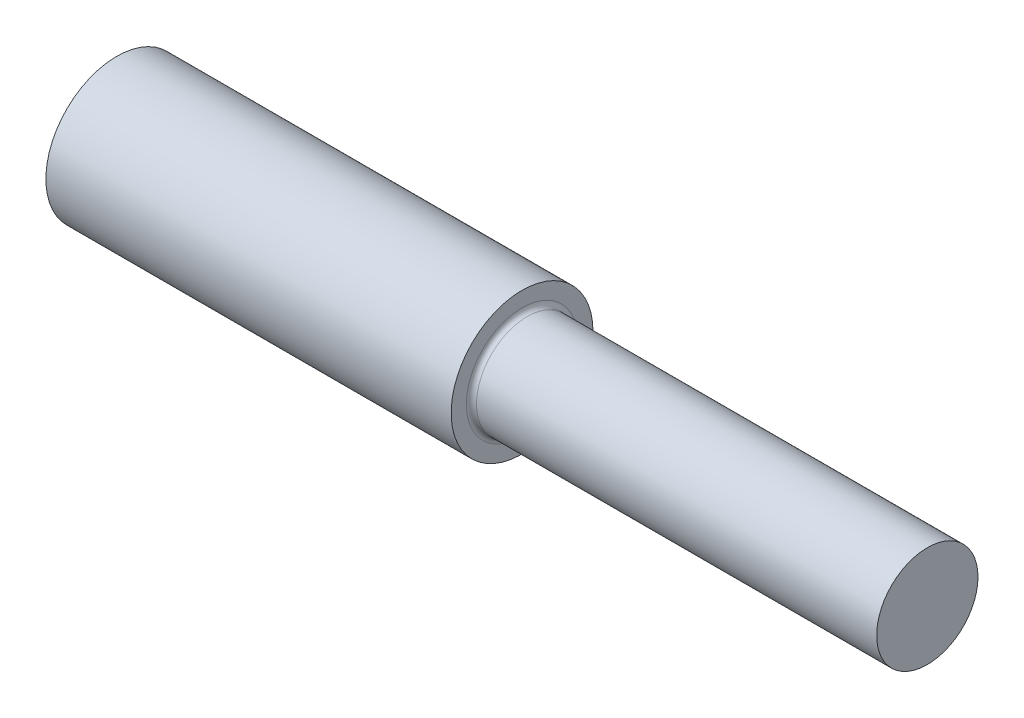
ISO-10303-21;
HEADER;
FILE_DESCRIPTION(('STEP AP214'),'2;1');
FILE_NAME('part.step','',(''),(''),'','','');
FILE_SCHEMA(('AUTOMOTIVE_DESIGN { 1 0 10303 214 1 1 1 1 }'));
ENDSEC;
DATA;
#1=APPLICATION_CONTEXT('core data for automotive mechanical design processes');
#2=APPLICATION_PROTOCOL_DEFINITION('international standard','automotive_design',2000,#1);
#3=PRODUCT_CONTEXT('',#1,'mechanical');
#4=PRODUCT('Part','Part','',(#3));
#5=PRODUCT_RELATED_PRODUCT_CATEGORY('part','',(#4));
#6=PRODUCT_DEFINITION_FORMATION('','',#4);
#7=PRODUCT_DEFINITION_CONTEXT('part definition',#1,'design');
#8=PRODUCT_DEFINITION('design','',#6,#7);
#9=PRODUCT_DEFINITION_SHAPE('','',#8);
#10=(LENGTH_UNIT() NAMED_UNIT(*) SI_UNIT(.MILLI.,.METRE.));
#11=(NAMED_UNIT(*) PLANE_ANGLE_UNIT() SI_UNIT($,.RADIAN.));
#12=(NAMED_UNIT(*) SI_UNIT($,.STERADIAN.) SOLID_ANGLE_UNIT());
#13=UNCERTAINTY_MEASURE_WITH_UNIT(LENGTH_MEASURE(1.E-05),#10,'distance_accuracy_value','');
#14=(GEOMETRIC_REPRESENTATION_CONTEXT(3) GLOBAL_UNCERTAINTY_ASSIGNED_CONTEXT((#13)) GLOBAL_UNIT_ASSIGNED_CONTEXT((#10,
#11,#12)) REPRESENTATION_CONTEXT('',''));
#15=CARTESIAN_POINT('',(0.,0.,0.));
#16=DIRECTION('',(0.,0.,1.));
#17=DIRECTION('',(1.,0.,0.));
#18=AXIS2_PLACEMENT_3D('',#15,#16,#17);
#19=CARTESIAN_POINT('',(101.6,0.,0.));
#20=DIRECTION('',(1.,0.,0.));
#21=DIRECTION('',(0.,0.,-1.));
#22=AXIS2_PLACEMENT_3D('',#19,#20,#21);
#23=PLANE('',#22);
#24=CARTESIAN_POINT('',(101.6,0.,0.));
#25=DIRECTION('',(1.,0.,0.));
#26=DIRECTION('',(0.,0.,-1.));
#27=AXIS2_PLACEMENT_3D('',#24,#25,#26);
#28=CIRCLE('',#27,13.97);
#29=CARTESIAN_POINT('',(101.6,0.,-13.97));
#30=VERTEX_POINT('',#29);
#31=EDGE_CURVE('E10',#30,#30,#28,.F.);
#32=ORIENTED_EDGE('',*,*,#31,.T.);
#33=EDGE_LOOP('',(#32));
#34=FACE_BOUND('',#33,.T.);
#35=CARTESIAN_POINT('',(101.6,0.,0.));
#36=DIRECTION('',(1.,0.,0.));
#37=DIRECTION('',(0.,0.,-1.));
#38=AXIS2_PLACEMENT_3D('',#35,#36,#37);
#39=CIRCLE('',#38,17.78);
#40=CARTESIAN_POINT('',(101.6,0.,-17.78));
#41=VERTEX_POINT('',#40);
#42=EDGE_CURVE('E41',#41,#41,#39,.T.);
#43=ORIENTED_EDGE('',*,*,#42,.T.);
#44=EDGE_LOOP('',(#43));
#45=FACE_BOUND('',#44,.T.);
#46=ADVANCED_FACE('F30',(#34,#45),#23,.T.);
#47=CARTESIAN_POINT('',(101.6,0.,0.));
#48=DIRECTION('',(-1.,0.,0.));
#49=DIRECTION('',(0.,0.,1.));
#50=AXIS2_PLACEMENT_3D('',#47,#48,#49);
#51=CYLINDRICAL_SURFACE('',#50,17.78);
#52=ORIENTED_EDGE('',*,*,#42,.F.);
#53=EDGE_LOOP('',(#52));
#54=FACE_BOUND('',#53,.T.);
#55=CARTESIAN_POINT('',(0.,0.,0.));
#56=DIRECTION('',(1.,0.,0.));
#57=DIRECTION('',(0.,0.,-1.));
#58=AXIS2_PLACEMENT_3D('',#55,#56,#57);
#59=CIRCLE('',#58,17.78);
#60=CARTESIAN_POINT('',(0.,0.,-17.78));
#61=VERTEX_POINT('',#60);
#62=EDGE_CURVE('E45',#61,#61,#59,.T.);
#63=ORIENTED_EDGE('',*,*,#62,.T.);
#64=EDGE_LOOP('',(#63));
#65=FACE_BOUND('',#64,.T.);
#66=ADVANCED_FACE('F65',(#54,#65),#51,.T.);
#67=CARTESIAN_POINT('',(0.,0.,0.));
#68=DIRECTION('',(1.,0.,0.));
#69=DIRECTION('',(0.,0.,-1.));
#70=AXIS2_PLACEMENT_3D('',#67,#68,#69);
#71=PLANE('',#70);
#72=ORIENTED_EDGE('',*,*,#62,.F.);
#73=EDGE_LOOP('',(#72));
#74=FACE_BOUND('',#73,.T.);
#75=ADVANCED_FACE('F58',(#74),#71,.F.);
#76=CARTESIAN_POINT('',(203.2,0.,0.));
#77=DIRECTION('',(-1.,0.,0.));
#78=DIRECTION('',(0.,0.,1.));
#79=AXIS2_PLACEMENT_3D('',#76,#77,#78);
#80=CYLINDRICAL_SURFACE('',#79,12.7);
#81=CARTESIAN_POINT('',(102.87,0.,0.));
#82=DIRECTION('',(1.,0.,0.));
#83=DIRECTION('',(0.,0.,-1.));
#84=AXIS2_PLACEMENT_3D('',#81,#82,#83);
#85=CIRCLE('',#84,12.7);
#86=CARTESIAN_POINT('',(102.87,0.,-12.7));
#87=VERTEX_POINT('',#86);
#88=EDGE_CURVE('E37',#87,#87,#85,.T.);
#89=ORIENTED_EDGE('',*,*,#88,.T.);
#90=EDGE_LOOP('',(#89));
#91=FACE_BOUND('',#90,.T.);
#92=CARTESIAN_POINT('',(203.2,0.,0.));
#93=DIRECTION('',(1.,0.,0.));
#94=DIRECTION('',(0.,0.,-1.));
#95=AXIS2_PLACEMENT_3D('',#92,#93,#94);
#96=CIRCLE('',#95,12.7);
#97=CARTESIAN_POINT('',(203.2,0.,-12.7));
#98=VERTEX_POINT('',#97);
#99=EDGE_CURVE('E49',#98,#98,#96,.T.);
#100=ORIENTED_EDGE('',*,*,#99,.F.);
#101=EDGE_LOOP('',(#100));
#102=FACE_BOUND('',#101,.T.);
#103=ADVANCED_FACE('F56',(#91,#102),#80,.T.);
#104=CARTESIAN_POINT('',(203.2,0.,0.));
#105=DIRECTION('',(1.,0.,0.));
#106=DIRECTION('',(0.,0.,-1.));
#107=AXIS2_PLACEMENT_3D('',#104,#105,#106);
#108=PLANE('',#107);
#109=ORIENTED_EDGE('',*,*,#99,.T.);
#110=EDGE_LOOP('',(#109));
#111=FACE_BOUND('',#110,.T.);
#112=ADVANCED_FACE('F54',(#111),#108,.T.);
#113=CARTESIAN_POINT('',(102.87,0.,0.));
#114=DIRECTION('',(1.,0.,0.));
#115=DIRECTION('',(0.,0.,-1.));
#116=AXIS2_PLACEMENT_3D('',#113,#114,#115);
#117=TOROIDAL_SURFACE('',#116,13.97,1.27);
#118=ORIENTED_EDGE('',*,*,#31,.F.);
#119=EDGE_LOOP('',(#118));
#120=FACE_BOUND('',#119,.T.);
#121=ORIENTED_EDGE('',*,*,#88,.F.);
#122=EDGE_LOOP('',(#121));
#123=FACE_BOUND('',#122,.T.);
#124=ADVANCED_FACE('F32',(#120,#123),#117,.F.);
#125=CLOSED_SHELL('',(#46,#66,#75,#103,#112,#124));
#126=MANIFOLD_SOLID_BREP('B2',#125);
#127=ADVANCED_BREP_SHAPE_REPRESENTATION('',(#18,#126),#14);
#128=SHAPE_DEFINITION_REPRESENTATION(#9,#127);
ENDSEC;
END-ISO-10303-21;
